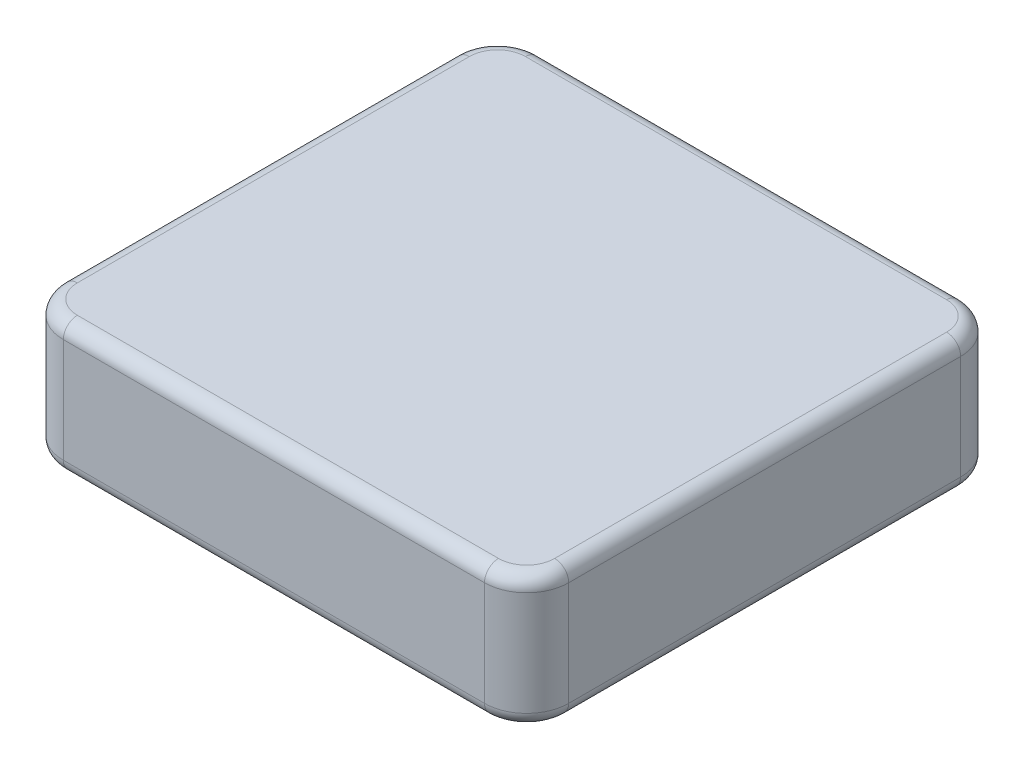
ISO-10303-21;
HEADER;
FILE_DESCRIPTION(('STEP AP214'),'2;1');
FILE_NAME('part.step','',(''),(''),'','','');
FILE_SCHEMA(('AUTOMOTIVE_DESIGN { 1 0 10303 214 1 1 1 1 }'));
ENDSEC;
DATA;
#1=APPLICATION_CONTEXT('core data for automotive mechanical design processes');
#2=APPLICATION_PROTOCOL_DEFINITION('international standard','automotive_design',2000,#1);
#3=PRODUCT_CONTEXT('',#1,'mechanical');
#4=PRODUCT('Part','Part','',(#3));
#5=PRODUCT_RELATED_PRODUCT_CATEGORY('part','',(#4));
#6=PRODUCT_DEFINITION_FORMATION('','',#4);
#7=PRODUCT_DEFINITION_CONTEXT('part definition',#1,'design');
#8=PRODUCT_DEFINITION('design','',#6,#7);
#9=PRODUCT_DEFINITION_SHAPE('','',#8);
#10=(LENGTH_UNIT() NAMED_UNIT(*) SI_UNIT(.MILLI.,.METRE.));
#11=(NAMED_UNIT(*) PLANE_ANGLE_UNIT() SI_UNIT($,.RADIAN.));
#12=(NAMED_UNIT(*) SI_UNIT($,.STERADIAN.) SOLID_ANGLE_UNIT());
#13=UNCERTAINTY_MEASURE_WITH_UNIT(LENGTH_MEASURE(1.E-05),#10,'distance_accuracy_value','');
#14=(GEOMETRIC_REPRESENTATION_CONTEXT(3) GLOBAL_UNCERTAINTY_ASSIGNED_CONTEXT((#13)) GLOBAL_UNIT_ASSIGNED_CONTEXT((#10,
#11,#12)) REPRESENTATION_CONTEXT('',''));
#15=CARTESIAN_POINT('',(0.,0.,0.));
#16=DIRECTION('',(0.,0.,1.));
#17=DIRECTION('',(1.,0.,0.));
#18=AXIS2_PLACEMENT_3D('',#15,#16,#17);
#19=CARTESIAN_POINT('',(-57.15,0.,53.848));
#20=DIRECTION('',(0.,0.,1.));
#21=DIRECTION('',(1.,0.,0.));
#22=AXIS2_PLACEMENT_3D('',#19,#20,#21);
#23=PLANE('',#22);
#24=DIRECTION('',(0.,1.,0.));
#25=VECTOR('',#24,1.);
#26=CARTESIAN_POINT('',(-47.625,0.,53.848));
#27=LINE('',#26,#25);
#28=CARTESIAN_POINT('',(-47.625,26.797,53.848));
#29=VERTEX_POINT('',#28);
#30=CARTESIAN_POINT('',(-47.625,3.175,53.848));
#31=VERTEX_POINT('',#30);
#32=EDGE_CURVE('E173',#29,#31,#27,.F.);
#33=ORIENTED_EDGE('',*,*,#32,.T.);
#34=DIRECTION('',(1.,0.,0.));
#35=VECTOR('',#34,1.);
#36=CARTESIAN_POINT('',(47.625,3.175,53.848));
#37=LINE('',#36,#35);
#38=CARTESIAN_POINT('',(47.625,3.175,53.848));
#39=VERTEX_POINT('',#38);
#40=EDGE_CURVE('E278',#31,#39,#37,.T.);
#41=ORIENTED_EDGE('',*,*,#40,.T.);
#42=DIRECTION('',(0.,1.,0.));
#43=VECTOR('',#42,1.);
#44=CARTESIAN_POINT('',(47.625,0.,53.848));
#45=LINE('',#44,#43);
#46=CARTESIAN_POINT('',(47.625,26.797,53.848));
#47=VERTEX_POINT('',#46);
#48=EDGE_CURVE('E585',#39,#47,#45,.T.);
#49=ORIENTED_EDGE('',*,*,#48,.T.);
#50=DIRECTION('',(1.,0.,0.));
#51=VECTOR('',#50,1.);
#52=CARTESIAN_POINT('',(-57.15,26.797,53.848));
#53=LINE('',#52,#51);
#54=EDGE_CURVE('E275',#47,#29,#53,.F.);
#55=ORIENTED_EDGE('',*,*,#54,.T.);
#56=EDGE_LOOP('',(#33,#41,#49,#55));
#57=FACE_BOUND('',#56,.T.);
#58=ADVANCED_FACE('F35',(#57),#23,.T.);
#59=CARTESIAN_POINT('',(-57.15,0.,-53.848));
#60=DIRECTION('',(-1.,0.,0.));
#61=DIRECTION('',(0.,0.,1.));
#62=AXIS2_PLACEMENT_3D('',#59,#60,#61);
#63=PLANE('',#62);
#64=DIRECTION('',(0.,1.,0.));
#65=VECTOR('',#64,1.);
#66=CARTESIAN_POINT('',(-57.15,0.,-44.323));
#67=LINE('',#66,#65);
#68=CARTESIAN_POINT('',(-57.15,26.797,-44.323));
#69=VERTEX_POINT('',#68);
#70=CARTESIAN_POINT('',(-57.15,3.175,-44.323));
#71=VERTEX_POINT('',#70);
#72=EDGE_CURVE('E335',#69,#71,#67,.F.);
#73=ORIENTED_EDGE('',*,*,#72,.T.);
#74=DIRECTION('',(0.,0.,1.));
#75=VECTOR('',#74,1.);
#76=CARTESIAN_POINT('',(-57.15,3.175,44.323));
#77=LINE('',#76,#75);
#78=CARTESIAN_POINT('',(-57.15,3.175,44.323));
#79=VERTEX_POINT('',#78);
#80=EDGE_CURVE('E176',#71,#79,#77,.T.);
#81=ORIENTED_EDGE('',*,*,#80,.T.);
#82=DIRECTION('',(0.,1.,0.));
#83=VECTOR('',#82,1.);
#84=CARTESIAN_POINT('',(-57.15,0.,44.323));
#85=LINE('',#84,#83);
#86=CARTESIAN_POINT('',(-57.15,26.797,44.323));
#87=VERTEX_POINT('',#86);
#88=EDGE_CURVE('E592',#79,#87,#85,.T.);
#89=ORIENTED_EDGE('',*,*,#88,.T.);
#90=DIRECTION('',(0.,0.,1.));
#91=VECTOR('',#90,1.);
#92=CARTESIAN_POINT('',(-57.15,26.797,-53.848));
#93=LINE('',#92,#91);
#94=EDGE_CURVE('E248',#87,#69,#93,.F.);
#95=ORIENTED_EDGE('',*,*,#94,.T.);
#96=EDGE_LOOP('',(#73,#81,#89,#95));
#97=FACE_BOUND('',#96,.T.);
#98=ADVANCED_FACE('F359',(#97),#63,.T.);
#99=CARTESIAN_POINT('',(57.15,0.,-53.848));
#100=DIRECTION('',(0.,0.,-1.));
#101=DIRECTION('',(-1.,0.,0.));
#102=AXIS2_PLACEMENT_3D('',#99,#100,#101);
#103=PLANE('',#102);
#104=DIRECTION('',(0.,1.,0.));
#105=VECTOR('',#104,1.);
#106=CARTESIAN_POINT('',(47.625,0.,-53.848));
#107=LINE('',#106,#105);
#108=CARTESIAN_POINT('',(47.625,26.797,-53.848));
#109=VERTEX_POINT('',#108);
#110=CARTESIAN_POINT('',(47.625,3.175,-53.848));
#111=VERTEX_POINT('',#110);
#112=EDGE_CURVE('E179',#109,#111,#107,.F.);
#113=ORIENTED_EDGE('',*,*,#112,.T.);
#114=DIRECTION('',(-1.,0.,0.));
#115=VECTOR('',#114,1.);
#116=CARTESIAN_POINT('',(-47.625,3.175,-53.848));
#117=LINE('',#116,#115);
#118=CARTESIAN_POINT('',(-47.625,3.175,-53.848));
#119=VERTEX_POINT('',#118);
#120=EDGE_CURVE('E240',#111,#119,#117,.T.);
#121=ORIENTED_EDGE('',*,*,#120,.T.);
#122=DIRECTION('',(0.,1.,0.));
#123=VECTOR('',#122,1.);
#124=CARTESIAN_POINT('',(-47.625,0.,-53.848));
#125=LINE('',#124,#123);
#126=CARTESIAN_POINT('',(-47.625,26.797,-53.848));
#127=VERTEX_POINT('',#126);
#128=EDGE_CURVE('E303',#119,#127,#125,.T.);
#129=ORIENTED_EDGE('',*,*,#128,.T.);
#130=DIRECTION('',(-1.,0.,0.));
#131=VECTOR('',#130,1.);
#132=CARTESIAN_POINT('',(57.15,26.797,-53.848));
#133=LINE('',#132,#131);
#134=EDGE_CURVE('E237',#127,#109,#133,.F.);
#135=ORIENTED_EDGE('',*,*,#134,.T.);
#136=EDGE_LOOP('',(#113,#121,#129,#135));
#137=FACE_BOUND('',#136,.T.);
#138=ADVANCED_FACE('F300',(#137),#103,.T.);
#139=CARTESIAN_POINT('',(57.15,0.,53.848));
#140=DIRECTION('',(1.,0.,0.));
#141=DIRECTION('',(0.,0.,-1.));
#142=AXIS2_PLACEMENT_3D('',#139,#140,#141);
#143=PLANE('',#142);
#144=DIRECTION('',(0.,1.,0.));
#145=VECTOR('',#144,1.);
#146=CARTESIAN_POINT('',(57.15,0.,44.323));
#147=LINE('',#146,#145);
#148=CARTESIAN_POINT('',(57.15,26.797,44.323));
#149=VERTEX_POINT('',#148);
#150=CARTESIAN_POINT('',(57.15,3.175,44.323));
#151=VERTEX_POINT('',#150);
#152=EDGE_CURVE('E331',#149,#151,#147,.F.);
#153=ORIENTED_EDGE('',*,*,#152,.T.);
#154=DIRECTION('',(0.,0.,-1.));
#155=VECTOR('',#154,1.);
#156=CARTESIAN_POINT('',(57.15,3.175,-44.323));
#157=LINE('',#156,#155);
#158=CARTESIAN_POINT('',(57.15,3.175,-44.323));
#159=VERTEX_POINT('',#158);
#160=EDGE_CURVE('E279',#151,#159,#157,.T.);
#161=ORIENTED_EDGE('',*,*,#160,.T.);
#162=DIRECTION('',(0.,1.,0.));
#163=VECTOR('',#162,1.);
#164=CARTESIAN_POINT('',(57.15,0.,-44.323));
#165=LINE('',#164,#163);
#166=CARTESIAN_POINT('',(57.15,26.797,-44.323));
#167=VERTEX_POINT('',#166);
#168=EDGE_CURVE('E295',#159,#167,#165,.T.);
#169=ORIENTED_EDGE('',*,*,#168,.T.);
#170=DIRECTION('',(0.,0.,-1.));
#171=VECTOR('',#170,1.);
#172=CARTESIAN_POINT('',(57.15,26.797,53.848));
#173=LINE('',#172,#171);
#174=EDGE_CURVE('E283',#167,#149,#173,.F.);
#175=ORIENTED_EDGE('',*,*,#174,.T.);
#176=EDGE_LOOP('',(#153,#161,#169,#175));
#177=FACE_BOUND('',#176,.T.);
#178=ADVANCED_FACE('F330',(#177),#143,.T.);
#179=CARTESIAN_POINT('',(0.,0.,0.));
#180=DIRECTION('',(0.,1.,0.));
#181=DIRECTION('',(0.,0.,1.));
#182=AXIS2_PLACEMENT_3D('',#179,#180,#181);
#183=PLANE('',#182);
#184=DIRECTION('',(0.,0.,-1.));
#185=VECTOR('',#184,1.);
#186=CARTESIAN_POINT('',(53.975,0.,44.323));
#187=LINE('',#186,#185);
#188=CARTESIAN_POINT('',(53.975,0.,-44.323));
#189=VERTEX_POINT('',#188);
#190=CARTESIAN_POINT('',(53.975,0.,44.323));
#191=VERTEX_POINT('',#190);
#192=EDGE_CURVE('E314',#189,#191,#187,.F.);
#193=ORIENTED_EDGE('',*,*,#192,.T.);
#194=CARTESIAN_POINT('',(47.625,0.,44.323));
#195=DIRECTION('',(0.,1.,0.));
#196=DIRECTION('',(0.,0.,1.));
#197=AXIS2_PLACEMENT_3D('',#194,#195,#196);
#198=CIRCLE('',#197,6.35);
#199=CARTESIAN_POINT('',(47.625,0.,50.673));
#200=VERTEX_POINT('',#199);
#201=EDGE_CURVE('E320',#191,#200,#198,.F.);
#202=ORIENTED_EDGE('',*,*,#201,.T.);
#203=DIRECTION('',(1.,0.,0.));
#204=VECTOR('',#203,1.);
#205=CARTESIAN_POINT('',(-47.625,0.,50.673));
#206=LINE('',#205,#204);
#207=CARTESIAN_POINT('',(-47.625,0.,50.673));
#208=VERTEX_POINT('',#207);
#209=EDGE_CURVE('E312',#200,#208,#206,.F.);
#210=ORIENTED_EDGE('',*,*,#209,.T.);
#211=CARTESIAN_POINT('',(-47.625,0.,44.323));
#212=DIRECTION('',(0.,1.,0.));
#213=DIRECTION('',(0.,0.,1.));
#214=AXIS2_PLACEMENT_3D('',#211,#212,#213);
#215=CIRCLE('',#214,6.35);
#216=CARTESIAN_POINT('',(-53.975,0.,44.323));
#217=VERTEX_POINT('',#216);
#218=EDGE_CURVE('E157',#208,#217,#215,.F.);
#219=ORIENTED_EDGE('',*,*,#218,.T.);
#220=DIRECTION('',(0.,0.,1.));
#221=VECTOR('',#220,1.);
#222=CARTESIAN_POINT('',(-53.975,0.,-44.323));
#223=LINE('',#222,#221);
#224=CARTESIAN_POINT('',(-53.975,0.,-44.323));
#225=VERTEX_POINT('',#224);
#226=EDGE_CURVE('E151',#217,#225,#223,.F.);
#227=ORIENTED_EDGE('',*,*,#226,.T.);
#228=CARTESIAN_POINT('',(-47.625,0.,-44.323));
#229=DIRECTION('',(0.,1.,0.));
#230=DIRECTION('',(0.,0.,1.));
#231=AXIS2_PLACEMENT_3D('',#228,#229,#230);
#232=CIRCLE('',#231,6.35);
#233=CARTESIAN_POINT('',(-47.625,0.,-50.673));
#234=VERTEX_POINT('',#233);
#235=EDGE_CURVE('E154',#225,#234,#232,.F.);
#236=ORIENTED_EDGE('',*,*,#235,.T.);
#237=DIRECTION('',(-1.,0.,0.));
#238=VECTOR('',#237,1.);
#239=CARTESIAN_POINT('',(47.625,0.,-50.673));
#240=LINE('',#239,#238);
#241=CARTESIAN_POINT('',(47.625,0.,-50.673));
#242=VERTEX_POINT('',#241);
#243=EDGE_CURVE('E162',#234,#242,#240,.F.);
#244=ORIENTED_EDGE('',*,*,#243,.T.);
#245=CARTESIAN_POINT('',(47.625,0.,-44.323));
#246=DIRECTION('',(0.,1.,0.));
#247=DIRECTION('',(0.,0.,1.));
#248=AXIS2_PLACEMENT_3D('',#245,#246,#247);
#249=CIRCLE('',#248,6.35);
#250=EDGE_CURVE('E310',#242,#189,#249,.F.);
#251=ORIENTED_EDGE('',*,*,#250,.T.);
#252=EDGE_LOOP('',(#193,#202,#210,#219,#227,#236,#244,#251));
#253=FACE_BOUND('',#252,.T.);
#254=ADVANCED_FACE('F153',(#253),#183,.F.);
#255=CARTESIAN_POINT('',(0.,29.972,0.));
#256=DIRECTION('',(0.,1.,0.));
#257=DIRECTION('',(0.,0.,1.));
#258=AXIS2_PLACEMENT_3D('',#255,#256,#257);
#259=PLANE('',#258);
#260=DIRECTION('',(0.,0.,1.));
#261=VECTOR('',#260,1.);
#262=CARTESIAN_POINT('',(-53.975,29.972,0.));
#263=LINE('',#262,#261);
#264=CARTESIAN_POINT('',(-53.975,29.972,-44.323));
#265=VERTEX_POINT('',#264);
#266=CARTESIAN_POINT('',(-53.975,29.972,44.323));
#267=VERTEX_POINT('',#266);
#268=EDGE_CURVE('E59',#265,#267,#263,.T.);
#269=ORIENTED_EDGE('',*,*,#268,.T.);
#270=CARTESIAN_POINT('',(-47.625,29.972,44.323));
#271=DIRECTION('',(0.,1.,0.));
#272=DIRECTION('',(0.,0.,1.));
#273=AXIS2_PLACEMENT_3D('',#270,#271,#272);
#274=CIRCLE('',#273,6.35);
#275=CARTESIAN_POINT('',(-47.625,29.972,50.673));
#276=VERTEX_POINT('',#275);
#277=EDGE_CURVE('E11',#267,#276,#274,.T.);
#278=ORIENTED_EDGE('',*,*,#277,.T.);
#279=DIRECTION('',(1.,0.,0.));
#280=VECTOR('',#279,1.);
#281=CARTESIAN_POINT('',(0.,29.972,50.673));
#282=LINE('',#281,#280);
#283=CARTESIAN_POINT('',(47.625,29.972,50.673));
#284=VERTEX_POINT('',#283);
#285=EDGE_CURVE('E44',#276,#284,#282,.T.);
#286=ORIENTED_EDGE('',*,*,#285,.T.);
#287=CARTESIAN_POINT('',(47.625,29.972,44.323));
#288=DIRECTION('',(0.,1.,0.));
#289=DIRECTION('',(0.,0.,1.));
#290=AXIS2_PLACEMENT_3D('',#287,#288,#289);
#291=CIRCLE('',#290,6.35);
#292=CARTESIAN_POINT('',(53.975,29.972,44.323));
#293=VERTEX_POINT('',#292);
#294=EDGE_CURVE('E263',#284,#293,#291,.T.);
#295=ORIENTED_EDGE('',*,*,#294,.T.);
#296=DIRECTION('',(0.,0.,-1.));
#297=VECTOR('',#296,1.);
#298=CARTESIAN_POINT('',(53.975,29.972,0.));
#299=LINE('',#298,#297);
#300=CARTESIAN_POINT('',(53.975,29.972,-44.323));
#301=VERTEX_POINT('',#300);
#302=EDGE_CURVE('E259',#293,#301,#299,.T.);
#303=ORIENTED_EDGE('',*,*,#302,.T.);
#304=CARTESIAN_POINT('',(47.625,29.972,-44.323));
#305=DIRECTION('',(0.,1.,0.));
#306=DIRECTION('',(0.,0.,1.));
#307=AXIS2_PLACEMENT_3D('',#304,#305,#306);
#308=CIRCLE('',#307,6.35);
#309=CARTESIAN_POINT('',(47.625,29.972,-50.673));
#310=VERTEX_POINT('',#309);
#311=EDGE_CURVE('E255',#301,#310,#308,.T.);
#312=ORIENTED_EDGE('',*,*,#311,.T.);
#313=DIRECTION('',(-1.,0.,0.));
#314=VECTOR('',#313,1.);
#315=CARTESIAN_POINT('',(0.,29.972,-50.673));
#316=LINE('',#315,#314);
#317=CARTESIAN_POINT('',(-47.625,29.972,-50.673));
#318=VERTEX_POINT('',#317);
#319=EDGE_CURVE('E257',#310,#318,#316,.T.);
#320=ORIENTED_EDGE('',*,*,#319,.T.);
#321=CARTESIAN_POINT('',(-47.625,29.972,-44.323));
#322=DIRECTION('',(0.,1.,0.));
#323=DIRECTION('',(0.,0.,1.));
#324=AXIS2_PLACEMENT_3D('',#321,#322,#323);
#325=CIRCLE('',#324,6.35);
#326=EDGE_CURVE('E261',#318,#265,#325,.T.);
#327=ORIENTED_EDGE('',*,*,#326,.T.);
#328=EDGE_LOOP('',(#269,#278,#286,#295,#303,#312,#320,#327));
#329=FACE_BOUND('',#328,.T.);
#330=ADVANCED_FACE('F266',(#329),#259,.T.);
#331=CARTESIAN_POINT('',(-47.625,0.,-44.323));
#332=DIRECTION('',(0.,1.,0.));
#333=DIRECTION('',(0.,0.,1.));
#334=AXIS2_PLACEMENT_3D('',#331,#332,#333);
#335=CYLINDRICAL_SURFACE('',#334,9.525);
#336=ORIENTED_EDGE('',*,*,#128,.F.);
#337=CARTESIAN_POINT('',(-47.625,3.175,-44.323));
#338=DIRECTION('',(0.,1.,0.));
#339=DIRECTION('',(0.,0.,1.));
#340=AXIS2_PLACEMENT_3D('',#337,#338,#339);
#341=CIRCLE('',#340,9.525);
#342=EDGE_CURVE('E253',#119,#71,#341,.T.);
#343=ORIENTED_EDGE('',*,*,#342,.T.);
#344=ORIENTED_EDGE('',*,*,#72,.F.);
#345=CARTESIAN_POINT('',(-47.625,26.797,-44.323));
#346=DIRECTION('',(0.,1.,0.));
#347=DIRECTION('',(0.,0.,1.));
#348=AXIS2_PLACEMENT_3D('',#345,#346,#347);
#349=CIRCLE('',#348,9.525);
#350=EDGE_CURVE('E251',#69,#127,#349,.F.);
#351=ORIENTED_EDGE('',*,*,#350,.T.);
#352=EDGE_LOOP('',(#336,#343,#344,#351));
#353=FACE_BOUND('',#352,.T.);
#354=ADVANCED_FACE('F369',(#353),#335,.T.);
#355=CARTESIAN_POINT('',(47.625,0.,-44.323));
#356=DIRECTION('',(0.,1.,0.));
#357=DIRECTION('',(0.,0.,1.));
#358=AXIS2_PLACEMENT_3D('',#355,#356,#357);
#359=CYLINDRICAL_SURFACE('',#358,9.525);
#360=ORIENTED_EDGE('',*,*,#168,.F.);
#361=CARTESIAN_POINT('',(47.625,3.175,-44.323));
#362=DIRECTION('',(0.,1.,0.));
#363=DIRECTION('',(0.,0.,1.));
#364=AXIS2_PLACEMENT_3D('',#361,#362,#363);
#365=CIRCLE('',#364,9.525);
#366=EDGE_CURVE('E243',#159,#111,#365,.T.);
#367=ORIENTED_EDGE('',*,*,#366,.T.);
#368=ORIENTED_EDGE('',*,*,#112,.F.);
#369=CARTESIAN_POINT('',(47.625,26.797,-44.323));
#370=DIRECTION('',(0.,1.,0.));
#371=DIRECTION('',(0.,0.,1.));
#372=AXIS2_PLACEMENT_3D('',#369,#370,#371);
#373=CIRCLE('',#372,9.525);
#374=EDGE_CURVE('E281',#109,#167,#373,.F.);
#375=ORIENTED_EDGE('',*,*,#374,.T.);
#376=EDGE_LOOP('',(#360,#367,#368,#375));
#377=FACE_BOUND('',#376,.T.);
#378=ADVANCED_FACE('F292',(#377),#359,.T.);
#379=CARTESIAN_POINT('',(-47.625,0.,44.323));
#380=DIRECTION('',(0.,1.,0.));
#381=DIRECTION('',(0.,0.,1.));
#382=AXIS2_PLACEMENT_3D('',#379,#380,#381);
#383=CYLINDRICAL_SURFACE('',#382,9.525);
#384=ORIENTED_EDGE('',*,*,#88,.F.);
#385=CARTESIAN_POINT('',(-47.625,3.175,44.323));
#386=DIRECTION('',(0.,1.,0.));
#387=DIRECTION('',(0.,0.,1.));
#388=AXIS2_PLACEMENT_3D('',#385,#386,#387);
#389=CIRCLE('',#388,9.525);
#390=EDGE_CURVE('E231',#79,#31,#389,.T.);
#391=ORIENTED_EDGE('',*,*,#390,.T.);
#392=ORIENTED_EDGE('',*,*,#32,.F.);
#393=CARTESIAN_POINT('',(-47.625,26.797,44.323));
#394=DIRECTION('',(0.,1.,0.));
#395=DIRECTION('',(0.,0.,1.));
#396=AXIS2_PLACEMENT_3D('',#393,#394,#395);
#397=CIRCLE('',#396,9.525);
#398=EDGE_CURVE('E238',#29,#87,#397,.F.);
#399=ORIENTED_EDGE('',*,*,#398,.T.);
#400=EDGE_LOOP('',(#384,#391,#392,#399));
#401=FACE_BOUND('',#400,.T.);
#402=ADVANCED_FACE('F375',(#401),#383,.T.);
#403=CARTESIAN_POINT('',(47.625,0.,44.323));
#404=DIRECTION('',(0.,1.,0.));
#405=DIRECTION('',(0.,0.,1.));
#406=AXIS2_PLACEMENT_3D('',#403,#404,#405);
#407=CYLINDRICAL_SURFACE('',#406,9.525);
#408=ORIENTED_EDGE('',*,*,#48,.F.);
#409=CARTESIAN_POINT('',(47.625,3.175,44.323));
#410=DIRECTION('',(0.,1.,0.));
#411=DIRECTION('',(0.,0.,1.));
#412=AXIS2_PLACEMENT_3D('',#409,#410,#411);
#413=CIRCLE('',#412,9.525);
#414=EDGE_CURVE('E325',#39,#151,#413,.T.);
#415=ORIENTED_EDGE('',*,*,#414,.T.);
#416=ORIENTED_EDGE('',*,*,#152,.F.);
#417=CARTESIAN_POINT('',(47.625,26.797,44.323));
#418=DIRECTION('',(0.,1.,0.));
#419=DIRECTION('',(0.,0.,1.));
#420=AXIS2_PLACEMENT_3D('',#417,#418,#419);
#421=CIRCLE('',#420,9.525);
#422=EDGE_CURVE('E323',#149,#47,#421,.F.);
#423=ORIENTED_EDGE('',*,*,#422,.T.);
#424=EDGE_LOOP('',(#408,#415,#416,#423));
#425=FACE_BOUND('',#424,.T.);
#426=ADVANCED_FACE('F334',(#425),#407,.T.);
#427=CARTESIAN_POINT('',(-47.625,3.175,-44.323));
#428=DIRECTION('',(0.,1.,0.));
#429=DIRECTION('',(0.,0.,1.));
#430=AXIS2_PLACEMENT_3D('',#427,#428,#429);
#431=TOROIDAL_SURFACE('',#430,6.35,3.175);
#432=CARTESIAN_POINT('',(-53.975,3.175,-44.323));
#433=DIRECTION('',(0.,0.,1.));
#434=DIRECTION('',(1.,0.,0.));
#435=AXIS2_PLACEMENT_3D('',#432,#433,#434);
#436=CIRCLE('',#435,3.175);
#437=EDGE_CURVE('E168',#71,#225,#436,.T.);
#438=ORIENTED_EDGE('',*,*,#437,.F.);
#439=ORIENTED_EDGE('',*,*,#342,.F.);
#440=CARTESIAN_POINT('',(-47.625,3.175,-50.673));
#441=DIRECTION('',(1.,0.,0.));
#442=DIRECTION('',(0.,0.,-1.));
#443=AXIS2_PLACEMENT_3D('',#440,#441,#442);
#444=CIRCLE('',#443,3.175);
#445=EDGE_CURVE('E171',#234,#119,#444,.T.);
#446=ORIENTED_EDGE('',*,*,#445,.F.);
#447=ORIENTED_EDGE('',*,*,#235,.F.);
#448=EDGE_LOOP('',(#438,#439,#446,#447));
#449=FACE_BOUND('',#448,.T.);
#450=ADVANCED_FACE('F166',(#449),#431,.T.);
#451=CARTESIAN_POINT('',(57.15,3.175,-50.673));
#452=DIRECTION('',(1.,0.,0.));
#453=DIRECTION('',(0.,0.,-1.));
#454=AXIS2_PLACEMENT_3D('',#451,#452,#453);
#455=CYLINDRICAL_SURFACE('',#454,3.175);
#456=ORIENTED_EDGE('',*,*,#445,.T.);
#457=ORIENTED_EDGE('',*,*,#120,.F.);
#458=CARTESIAN_POINT('',(47.625,3.175,-50.673));
#459=DIRECTION('',(1.,0.,0.));
#460=DIRECTION('',(0.,0.,-1.));
#461=AXIS2_PLACEMENT_3D('',#458,#459,#460);
#462=CIRCLE('',#461,3.175);
#463=EDGE_CURVE('E177',#242,#111,#462,.T.);
#464=ORIENTED_EDGE('',*,*,#463,.F.);
#465=ORIENTED_EDGE('',*,*,#243,.F.);
#466=EDGE_LOOP('',(#456,#457,#464,#465));
#467=FACE_BOUND('',#466,.T.);
#468=ADVANCED_FACE('F307',(#467),#455,.T.);
#469=CARTESIAN_POINT('',(-53.975,3.175,-53.848));
#470=DIRECTION('',(0.,0.,-1.));
#471=DIRECTION('',(-1.,0.,0.));
#472=AXIS2_PLACEMENT_3D('',#469,#470,#471);
#473=CYLINDRICAL_SURFACE('',#472,3.175);
#474=ORIENTED_EDGE('',*,*,#437,.T.);
#475=ORIENTED_EDGE('',*,*,#226,.F.);
#476=CARTESIAN_POINT('',(-53.975,3.175,44.323));
#477=DIRECTION('',(0.,0.,1.));
#478=DIRECTION('',(1.,0.,0.));
#479=AXIS2_PLACEMENT_3D('',#476,#477,#478);
#480=CIRCLE('',#479,3.175);
#481=EDGE_CURVE('E182',#79,#217,#480,.T.);
#482=ORIENTED_EDGE('',*,*,#481,.F.);
#483=ORIENTED_EDGE('',*,*,#80,.F.);
#484=EDGE_LOOP('',(#474,#475,#482,#483));
#485=FACE_BOUND('',#484,.T.);
#486=ADVANCED_FACE('F175',(#485),#473,.T.);
#487=CARTESIAN_POINT('',(47.625,3.175,-44.323));
#488=DIRECTION('',(0.,1.,0.));
#489=DIRECTION('',(0.,0.,1.));
#490=AXIS2_PLACEMENT_3D('',#487,#488,#489);
#491=TOROIDAL_SURFACE('',#490,6.35,3.175);
#492=ORIENTED_EDGE('',*,*,#463,.T.);
#493=ORIENTED_EDGE('',*,*,#366,.F.);
#494=CARTESIAN_POINT('',(53.975,3.175,-44.323));
#495=DIRECTION('',(0.,0.,1.));
#496=DIRECTION('',(1.,0.,0.));
#497=AXIS2_PLACEMENT_3D('',#494,#495,#496);
#498=CIRCLE('',#497,3.175);
#499=EDGE_CURVE('E225',#189,#159,#498,.T.);
#500=ORIENTED_EDGE('',*,*,#499,.F.);
#501=ORIENTED_EDGE('',*,*,#250,.F.);
#502=EDGE_LOOP('',(#492,#493,#500,#501));
#503=FACE_BOUND('',#502,.T.);
#504=ADVANCED_FACE('F309',(#503),#491,.T.);
#505=CARTESIAN_POINT('',(-47.625,3.175,44.323));
#506=DIRECTION('',(0.,1.,0.));
#507=DIRECTION('',(0.,0.,1.));
#508=AXIS2_PLACEMENT_3D('',#505,#506,#507);
#509=TOROIDAL_SURFACE('',#508,6.35,3.175);
#510=ORIENTED_EDGE('',*,*,#481,.T.);
#511=ORIENTED_EDGE('',*,*,#218,.F.);
#512=CARTESIAN_POINT('',(-47.625,3.175,50.673));
#513=DIRECTION('',(1.,0.,0.));
#514=DIRECTION('',(0.,0.,-1.));
#515=AXIS2_PLACEMENT_3D('',#512,#513,#514);
#516=CIRCLE('',#515,3.175);
#517=EDGE_CURVE('E219',#31,#208,#516,.T.);
#518=ORIENTED_EDGE('',*,*,#517,.F.);
#519=ORIENTED_EDGE('',*,*,#390,.F.);
#520=EDGE_LOOP('',(#510,#511,#518,#519));
#521=FACE_BOUND('',#520,.T.);
#522=ADVANCED_FACE('F229',(#521),#509,.T.);
#523=CARTESIAN_POINT('',(53.975,3.175,53.848));
#524=DIRECTION('',(0.,0.,1.));
#525=DIRECTION('',(1.,0.,0.));
#526=AXIS2_PLACEMENT_3D('',#523,#524,#525);
#527=CYLINDRICAL_SURFACE('',#526,3.175);
#528=ORIENTED_EDGE('',*,*,#499,.T.);
#529=ORIENTED_EDGE('',*,*,#160,.F.);
#530=CARTESIAN_POINT('',(53.975,3.175,44.323));
#531=DIRECTION('',(0.,0.,1.));
#532=DIRECTION('',(1.,0.,0.));
#533=AXIS2_PLACEMENT_3D('',#530,#531,#532);
#534=CIRCLE('',#533,3.175);
#535=EDGE_CURVE('E212',#191,#151,#534,.T.);
#536=ORIENTED_EDGE('',*,*,#535,.F.);
#537=ORIENTED_EDGE('',*,*,#192,.F.);
#538=EDGE_LOOP('',(#528,#529,#536,#537));
#539=FACE_BOUND('',#538,.T.);
#540=ADVANCED_FACE('F386',(#539),#527,.T.);
#541=CARTESIAN_POINT('',(-57.15,3.175,50.673));
#542=DIRECTION('',(-1.,0.,0.));
#543=DIRECTION('',(0.,0.,1.));
#544=AXIS2_PLACEMENT_3D('',#541,#542,#543);
#545=CYLINDRICAL_SURFACE('',#544,3.175);
#546=ORIENTED_EDGE('',*,*,#517,.T.);
#547=ORIENTED_EDGE('',*,*,#209,.F.);
#548=CARTESIAN_POINT('',(47.625,3.175,50.673));
#549=DIRECTION('',(1.,0.,0.));
#550=DIRECTION('',(0.,0.,-1.));
#551=AXIS2_PLACEMENT_3D('',#548,#549,#550);
#552=CIRCLE('',#551,3.175);
#553=EDGE_CURVE('E207',#39,#200,#552,.T.);
#554=ORIENTED_EDGE('',*,*,#553,.F.);
#555=ORIENTED_EDGE('',*,*,#40,.F.);
#556=EDGE_LOOP('',(#546,#547,#554,#555));
#557=FACE_BOUND('',#556,.T.);
#558=ADVANCED_FACE('F383',(#557),#545,.T.);
#559=CARTESIAN_POINT('',(47.625,3.175,44.323));
#560=DIRECTION('',(0.,1.,0.));
#561=DIRECTION('',(0.,0.,1.));
#562=AXIS2_PLACEMENT_3D('',#559,#560,#561);
#563=TOROIDAL_SURFACE('',#562,6.35,3.175);
#564=ORIENTED_EDGE('',*,*,#535,.T.);
#565=ORIENTED_EDGE('',*,*,#414,.F.);
#566=ORIENTED_EDGE('',*,*,#553,.T.);
#567=ORIENTED_EDGE('',*,*,#201,.F.);
#568=EDGE_LOOP('',(#564,#565,#566,#567));
#569=FACE_BOUND('',#568,.T.);
#570=ADVANCED_FACE('F380',(#569),#563,.T.);
#571=CARTESIAN_POINT('',(47.625,26.797,-44.323));
#572=DIRECTION('',(0.,1.,0.));
#573=DIRECTION('',(0.,0.,1.));
#574=AXIS2_PLACEMENT_3D('',#571,#572,#573);
#575=TOROIDAL_SURFACE('',#574,6.35,3.175);
#576=CARTESIAN_POINT('',(53.975,26.797,-44.323));
#577=DIRECTION('',(0.,0.,1.));
#578=DIRECTION('',(1.,0.,0.));
#579=AXIS2_PLACEMENT_3D('',#576,#577,#578);
#580=CIRCLE('',#579,3.175);
#581=EDGE_CURVE('E200',#167,#301,#580,.T.);
#582=ORIENTED_EDGE('',*,*,#581,.F.);
#583=ORIENTED_EDGE('',*,*,#374,.F.);
#584=CARTESIAN_POINT('',(47.625,26.797,-50.673));
#585=DIRECTION('',(-1.,0.,0.));
#586=DIRECTION('',(0.,0.,1.));
#587=AXIS2_PLACEMENT_3D('',#584,#585,#586);
#588=CIRCLE('',#587,3.175);
#589=EDGE_CURVE('E39',#310,#109,#588,.T.);
#590=ORIENTED_EDGE('',*,*,#589,.F.);
#591=ORIENTED_EDGE('',*,*,#311,.F.);
#592=EDGE_LOOP('',(#582,#583,#590,#591));
#593=FACE_BOUND('',#592,.T.);
#594=ADVANCED_FACE('F37',(#593),#575,.T.);
#595=CARTESIAN_POINT('',(0.,26.797,-50.673));
#596=DIRECTION('',(-1.,0.,0.));
#597=DIRECTION('',(0.,0.,1.));
#598=AXIS2_PLACEMENT_3D('',#595,#596,#597);
#599=CYLINDRICAL_SURFACE('',#598,3.175);
#600=ORIENTED_EDGE('',*,*,#589,.T.);
#601=ORIENTED_EDGE('',*,*,#134,.F.);
#602=CARTESIAN_POINT('',(-47.625,26.797,-50.673));
#603=DIRECTION('',(-1.,0.,0.));
#604=DIRECTION('',(0.,0.,1.));
#605=AXIS2_PLACEMENT_3D('',#602,#603,#604);
#606=CIRCLE('',#605,3.175);
#607=EDGE_CURVE('E198',#318,#127,#606,.T.);
#608=ORIENTED_EDGE('',*,*,#607,.F.);
#609=ORIENTED_EDGE('',*,*,#319,.F.);
#610=EDGE_LOOP('',(#600,#601,#608,#609));
#611=FACE_BOUND('',#610,.T.);
#612=ADVANCED_FACE('F341',(#611),#599,.T.);
#613=CARTESIAN_POINT('',(53.975,26.797,0.));
#614=DIRECTION('',(0.,0.,-1.));
#615=DIRECTION('',(-1.,0.,0.));
#616=AXIS2_PLACEMENT_3D('',#613,#614,#615);
#617=CYLINDRICAL_SURFACE('',#616,3.175);
#618=ORIENTED_EDGE('',*,*,#581,.T.);
#619=ORIENTED_EDGE('',*,*,#302,.F.);
#620=CARTESIAN_POINT('',(53.975,26.797,44.323));
#621=DIRECTION('',(0.,0.,1.));
#622=DIRECTION('',(1.,0.,0.));
#623=AXIS2_PLACEMENT_3D('',#620,#621,#622);
#624=CIRCLE('',#623,3.175);
#625=EDGE_CURVE('E195',#149,#293,#624,.T.);
#626=ORIENTED_EDGE('',*,*,#625,.F.);
#627=ORIENTED_EDGE('',*,*,#174,.F.);
#628=EDGE_LOOP('',(#618,#619,#626,#627));
#629=FACE_BOUND('',#628,.T.);
#630=ADVANCED_FACE('F337',(#629),#617,.T.);
#631=CARTESIAN_POINT('',(-47.625,26.797,-44.323));
#632=DIRECTION('',(0.,1.,0.));
#633=DIRECTION('',(0.,0.,1.));
#634=AXIS2_PLACEMENT_3D('',#631,#632,#633);
#635=TOROIDAL_SURFACE('',#634,6.35,3.175);
#636=ORIENTED_EDGE('',*,*,#607,.T.);
#637=ORIENTED_EDGE('',*,*,#350,.F.);
#638=CARTESIAN_POINT('',(-53.975,26.797,-44.323));
#639=DIRECTION('',(0.,0.,1.));
#640=DIRECTION('',(1.,0.,0.));
#641=AXIS2_PLACEMENT_3D('',#638,#639,#640);
#642=CIRCLE('',#641,3.175);
#643=EDGE_CURVE('E192',#265,#69,#642,.T.);
#644=ORIENTED_EDGE('',*,*,#643,.F.);
#645=ORIENTED_EDGE('',*,*,#326,.F.);
#646=EDGE_LOOP('',(#636,#637,#644,#645));
#647=FACE_BOUND('',#646,.T.);
#648=ADVANCED_FACE('F346',(#647),#635,.T.);
#649=CARTESIAN_POINT('',(47.625,26.797,44.323));
#650=DIRECTION('',(0.,1.,0.));
#651=DIRECTION('',(0.,0.,1.));
#652=AXIS2_PLACEMENT_3D('',#649,#650,#651);
#653=TOROIDAL_SURFACE('',#652,6.35,3.175);
#654=ORIENTED_EDGE('',*,*,#625,.T.);
#655=ORIENTED_EDGE('',*,*,#294,.F.);
#656=CARTESIAN_POINT('',(47.625,26.797,50.673));
#657=DIRECTION('',(-1.,0.,0.));
#658=DIRECTION('',(0.,0.,1.));
#659=AXIS2_PLACEMENT_3D('',#656,#657,#658);
#660=CIRCLE('',#659,3.175);
#661=EDGE_CURVE('E189',#47,#284,#660,.T.);
#662=ORIENTED_EDGE('',*,*,#661,.F.);
#663=ORIENTED_EDGE('',*,*,#422,.F.);
#664=EDGE_LOOP('',(#654,#655,#662,#663));
#665=FACE_BOUND('',#664,.T.);
#666=ADVANCED_FACE('F270',(#665),#653,.T.);
#667=CARTESIAN_POINT('',(-53.975,26.797,0.));
#668=DIRECTION('',(0.,0.,1.));
#669=DIRECTION('',(1.,0.,0.));
#670=AXIS2_PLACEMENT_3D('',#667,#668,#669);
#671=CYLINDRICAL_SURFACE('',#670,3.175);
#672=ORIENTED_EDGE('',*,*,#643,.T.);
#673=ORIENTED_EDGE('',*,*,#94,.F.);
#674=CARTESIAN_POINT('',(-53.975,26.797,44.323));
#675=DIRECTION('',(0.,0.,1.));
#676=DIRECTION('',(1.,0.,0.));
#677=AXIS2_PLACEMENT_3D('',#674,#675,#676);
#678=CIRCLE('',#677,3.175);
#679=EDGE_CURVE('E187',#267,#87,#678,.T.);
#680=ORIENTED_EDGE('',*,*,#679,.F.);
#681=ORIENTED_EDGE('',*,*,#268,.F.);
#682=EDGE_LOOP('',(#672,#673,#680,#681));
#683=FACE_BOUND('',#682,.T.);
#684=ADVANCED_FACE('F349',(#683),#671,.T.);
#685=CARTESIAN_POINT('',(0.,26.797,50.673));
#686=DIRECTION('',(1.,0.,0.));
#687=DIRECTION('',(0.,0.,-1.));
#688=AXIS2_PLACEMENT_3D('',#685,#686,#687);
#689=CYLINDRICAL_SURFACE('',#688,3.175);
#690=ORIENTED_EDGE('',*,*,#661,.T.);
#691=ORIENTED_EDGE('',*,*,#285,.F.);
#692=CARTESIAN_POINT('',(-47.625,26.797,50.673));
#693=DIRECTION('',(-1.,0.,0.));
#694=DIRECTION('',(0.,0.,1.));
#695=AXIS2_PLACEMENT_3D('',#692,#693,#694);
#696=CIRCLE('',#695,3.175);
#697=EDGE_CURVE('E52',#29,#276,#696,.T.);
#698=ORIENTED_EDGE('',*,*,#697,.F.);
#699=ORIENTED_EDGE('',*,*,#54,.F.);
#700=EDGE_LOOP('',(#690,#691,#698,#699));
#701=FACE_BOUND('',#700,.T.);
#702=ADVANCED_FACE('F274',(#701),#689,.T.);
#703=CARTESIAN_POINT('',(-47.625,26.797,44.323));
#704=DIRECTION('',(0.,1.,0.));
#705=DIRECTION('',(0.,0.,1.));
#706=AXIS2_PLACEMENT_3D('',#703,#704,#705);
#707=TOROIDAL_SURFACE('',#706,6.35,3.175);
#708=ORIENTED_EDGE('',*,*,#679,.T.);
#709=ORIENTED_EDGE('',*,*,#398,.F.);
#710=ORIENTED_EDGE('',*,*,#697,.T.);
#711=ORIENTED_EDGE('',*,*,#277,.F.);
#712=EDGE_LOOP('',(#708,#709,#710,#711));
#713=FACE_BOUND('',#712,.T.);
#714=ADVANCED_FACE('F350',(#713),#707,.T.);
#715=CLOSED_SHELL('',(#58,#98,#138,#178,#254,#330,#354,#378,#402,#426,#450,#468,#486,#504,#522,
#540,#558,#570,#594,#612,#630,#648,#666,#684,#702,#714));
#716=MANIFOLD_SOLID_BREP('B2',#715);
#717=ADVANCED_BREP_SHAPE_REPRESENTATION('',(#18,#716),#14);
#718=SHAPE_DEFINITION_REPRESENTATION(#9,#717);
ENDSEC;
END-ISO-10303-21;
